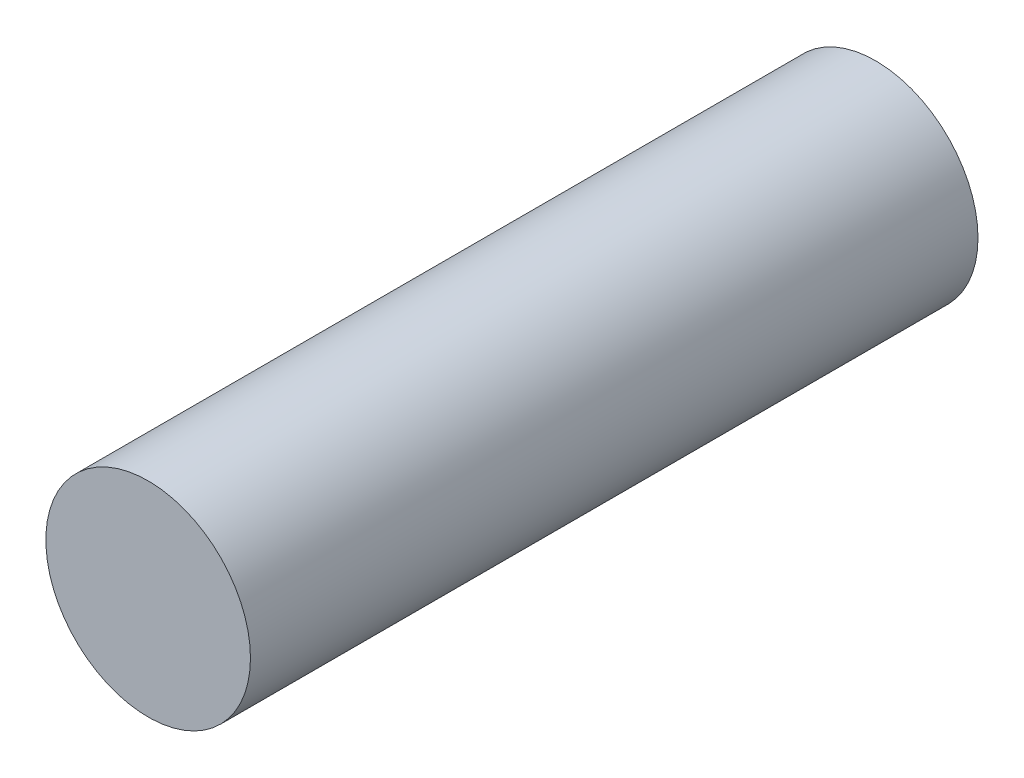
ISO-10303-21;
HEADER;
FILE_DESCRIPTION(('STEP AP214'),'2;1');
FILE_NAME('part.step','',(''),(''),'','','');
FILE_SCHEMA(('AUTOMOTIVE_DESIGN { 1 0 10303 214 1 1 1 1 }'));
ENDSEC;
DATA;
#1=APPLICATION_CONTEXT('core data for automotive mechanical design processes');
#2=APPLICATION_PROTOCOL_DEFINITION('international standard','automotive_design',2000,#1);
#3=PRODUCT_CONTEXT('',#1,'mechanical');
#4=PRODUCT('Part','Part','',(#3));
#5=PRODUCT_RELATED_PRODUCT_CATEGORY('part','',(#4));
#6=PRODUCT_DEFINITION_FORMATION('','',#4);
#7=PRODUCT_DEFINITION_CONTEXT('part definition',#1,'design');
#8=PRODUCT_DEFINITION('design','',#6,#7);
#9=PRODUCT_DEFINITION_SHAPE('','',#8);
#10=(LENGTH_UNIT() NAMED_UNIT(*) SI_UNIT(.MILLI.,.METRE.));
#11=(NAMED_UNIT(*) PLANE_ANGLE_UNIT() SI_UNIT($,.RADIAN.));
#12=(NAMED_UNIT(*) SI_UNIT($,.STERADIAN.) SOLID_ANGLE_UNIT());
#13=UNCERTAINTY_MEASURE_WITH_UNIT(LENGTH_MEASURE(1.E-05),#10,'distance_accuracy_value','');
#14=(GEOMETRIC_REPRESENTATION_CONTEXT(3) GLOBAL_UNCERTAINTY_ASSIGNED_CONTEXT((#13)) GLOBAL_UNIT_ASSIGNED_CONTEXT((#10,
#11,#12)) REPRESENTATION_CONTEXT('',''));
#15=CARTESIAN_POINT('',(0.,0.,0.));
#16=DIRECTION('',(0.,0.,1.));
#17=DIRECTION('',(1.,0.,0.));
#18=AXIS2_PLACEMENT_3D('',#15,#16,#17);
#19=CARTESIAN_POINT('',(0.,0.,16.));
#20=DIRECTION('',(0.,0.,-1.));
#21=DIRECTION('',(-1.,0.,0.));
#22=AXIS2_PLACEMENT_3D('',#19,#20,#21);
#23=CYLINDRICAL_SURFACE('',#22,2.25);
#24=CARTESIAN_POINT('',(0.,0.,16.));
#25=DIRECTION('',(0.,0.,1.));
#26=DIRECTION('',(1.,0.,0.));
#27=AXIS2_PLACEMENT_3D('',#24,#25,#26);
#28=CIRCLE('',#27,2.25);
#29=CARTESIAN_POINT('',(2.25,0.,16.));
#30=VERTEX_POINT('',#29);
#31=EDGE_CURVE('E10',#30,#30,#28,.T.);
#32=ORIENTED_EDGE('',*,*,#31,.F.);
#33=EDGE_LOOP('',(#32));
#34=FACE_BOUND('',#33,.T.);
#35=CARTESIAN_POINT('',(0.,0.,0.));
#36=DIRECTION('',(0.,0.,1.));
#37=DIRECTION('',(1.,0.,0.));
#38=AXIS2_PLACEMENT_3D('',#35,#36,#37);
#39=CIRCLE('',#38,2.25);
#40=CARTESIAN_POINT('',(2.25,0.,0.));
#41=VERTEX_POINT('',#40);
#42=EDGE_CURVE('E38',#41,#41,#39,.T.);
#43=ORIENTED_EDGE('',*,*,#42,.T.);
#44=EDGE_LOOP('',(#43));
#45=FACE_BOUND('',#44,.T.);
#46=ADVANCED_FACE('F35',(#34,#45),#23,.T.);
#47=CARTESIAN_POINT('',(0.,0.,16.));
#48=DIRECTION('',(0.,0.,1.));
#49=DIRECTION('',(1.,0.,0.));
#50=AXIS2_PLACEMENT_3D('',#47,#48,#49);
#51=PLANE('',#50);
#52=ORIENTED_EDGE('',*,*,#31,.T.);
#53=EDGE_LOOP('',(#52));
#54=FACE_BOUND('',#53,.T.);
#55=ADVANCED_FACE('F50',(#54),#51,.T.);
#56=CARTESIAN_POINT('',(0.,0.,0.));
#57=DIRECTION('',(0.,0.,1.));
#58=DIRECTION('',(1.,0.,0.));
#59=AXIS2_PLACEMENT_3D('',#56,#57,#58);
#60=PLANE('',#59);
#61=ORIENTED_EDGE('',*,*,#42,.F.);
#62=EDGE_LOOP('',(#61));
#63=FACE_BOUND('',#62,.T.);
#64=ADVANCED_FACE('F48',(#63),#60,.F.);
#65=CLOSED_SHELL('',(#46,#55,#64));
#66=MANIFOLD_SOLID_BREP('B2',#65);
#67=ADVANCED_BREP_SHAPE_REPRESENTATION('',(#18,#66),#14);
#68=SHAPE_DEFINITION_REPRESENTATION(#9,#67);
ENDSEC;
END-ISO-10303-21;
